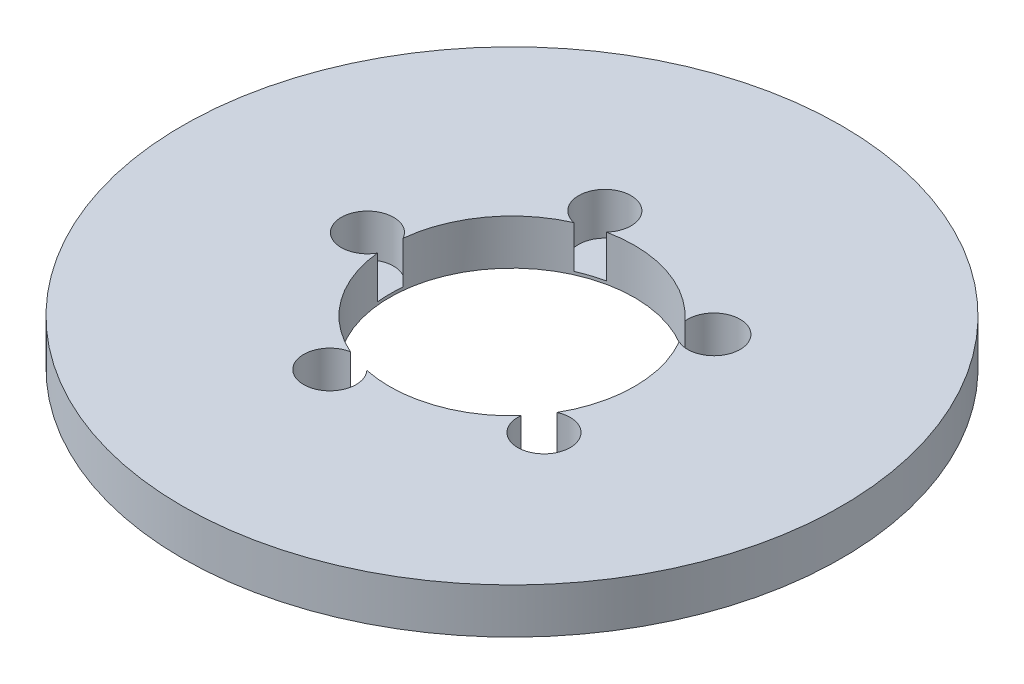
ISO-10303-21;
HEADER;
FILE_DESCRIPTION(('STEP AP214'),'2;1');
FILE_NAME('part.step','',(''),(''),'','','');
FILE_SCHEMA(('AUTOMOTIVE_DESIGN { 1 0 10303 214 1 1 1 1 }'));
ENDSEC;
DATA;
#1=APPLICATION_CONTEXT('core data for automotive mechanical design processes');
#2=APPLICATION_PROTOCOL_DEFINITION('international standard','automotive_design',2000,#1);
#3=PRODUCT_CONTEXT('',#1,'mechanical');
#4=PRODUCT('Part','Part','',(#3));
#5=PRODUCT_RELATED_PRODUCT_CATEGORY('part','',(#4));
#6=PRODUCT_DEFINITION_FORMATION('','',#4);
#7=PRODUCT_DEFINITION_CONTEXT('part definition',#1,'design');
#8=PRODUCT_DEFINITION('design','',#6,#7);
#9=PRODUCT_DEFINITION_SHAPE('','',#8);
#10=(LENGTH_UNIT() NAMED_UNIT(*) SI_UNIT(.MILLI.,.METRE.));
#11=(NAMED_UNIT(*) PLANE_ANGLE_UNIT() SI_UNIT($,.RADIAN.));
#12=(NAMED_UNIT(*) SI_UNIT($,.STERADIAN.) SOLID_ANGLE_UNIT());
#13=UNCERTAINTY_MEASURE_WITH_UNIT(LENGTH_MEASURE(1.E-05),#10,'distance_accuracy_value','');
#14=(GEOMETRIC_REPRESENTATION_CONTEXT(3) GLOBAL_UNCERTAINTY_ASSIGNED_CONTEXT((#13)) GLOBAL_UNIT_ASSIGNED_CONTEXT((#10,
#11,#12)) REPRESENTATION_CONTEXT('',''));
#15=CARTESIAN_POINT('',(0.,0.,0.));
#16=DIRECTION('',(0.,0.,1.));
#17=DIRECTION('',(1.,0.,0.));
#18=AXIS2_PLACEMENT_3D('',#15,#16,#17);
#19=CARTESIAN_POINT('',(0.,12.,0.));
#20=DIRECTION('',(0.,-1.,0.));
#21=DIRECTION('',(0.,0.,-1.));
#22=AXIS2_PLACEMENT_3D('',#19,#20,#21);
#23=CYLINDRICAL_SURFACE('',#22,87.5);
#24=CARTESIAN_POINT('',(0.,12.,0.));
#25=DIRECTION('',(0.,1.,0.));
#26=DIRECTION('',(0.,0.,1.));
#27=AXIS2_PLACEMENT_3D('',#24,#25,#26);
#28=CIRCLE('',#27,87.5);
#29=CARTESIAN_POINT('',(0.,12.,87.5));
#30=VERTEX_POINT('',#29);
#31=EDGE_CURVE('E160',#30,#30,#28,.T.);
#32=ORIENTED_EDGE('',*,*,#31,.F.);
#33=EDGE_LOOP('',(#32));
#34=FACE_BOUND('',#33,.T.);
#35=CARTESIAN_POINT('',(0.,0.,0.));
#36=DIRECTION('',(0.,1.,0.));
#37=DIRECTION('',(0.,0.,1.));
#38=AXIS2_PLACEMENT_3D('',#35,#36,#37);
#39=CIRCLE('',#38,87.5);
#40=CARTESIAN_POINT('',(0.,0.,87.5));
#41=VERTEX_POINT('',#40);
#42=EDGE_CURVE('E153',#41,#41,#39,.T.);
#43=ORIENTED_EDGE('',*,*,#42,.T.);
#44=EDGE_LOOP('',(#43));
#45=FACE_BOUND('',#44,.T.);
#46=ADVANCED_FACE('F39',(#34,#45),#23,.T.);
#47=CARTESIAN_POINT('',(0.,12.,0.));
#48=DIRECTION('',(0.,1.,0.));
#49=DIRECTION('',(0.,0.,1.));
#50=AXIS2_PLACEMENT_3D('',#47,#48,#49);
#51=PLANE('',#50);
#52=CARTESIAN_POINT('',(-11.860279917267,12.,36.5021882476634));
#53=DIRECTION('',(0.,1.,0.));
#54=DIRECTION('',(0.951056516295155,0.,0.309016994374945));
#55=AXIS2_PLACEMENT_3D('',#52,#53,#54);
#56=CIRCLE('',#55,6.96053116031876);
#57=CARTESIAN_POINT('',(-13.2416508527588,12.,29.6801058403374));
#58=VERTEX_POINT('',#57);
#59=CARTESIAN_POINT('',(-6.73280792596846,12.,31.7949571069378));
#60=VERTEX_POINT('',#59);
#61=EDGE_CURVE('E186',#58,#60,#56,.T.);
#62=ORIENTED_EDGE('',*,*,#61,.F.);
#63=CARTESIAN_POINT('',(0.,12.,0.));
#64=DIRECTION('',(0.,1.,0.));
#65=DIRECTION('',(0.,0.,1.));
#66=AXIS2_PLACEMENT_3D('',#63,#64,#65);
#67=CIRCLE('',#66,32.5);
#68=CARTESIAN_POINT('',(-32.3193532108647,12.,3.42190123051027));
#69=VERTEX_POINT('',#68);
#70=EDGE_CURVE('E148',#69,#58,#67,.T.);
#71=ORIENTED_EDGE('',*,*,#70,.F.);
#72=CARTESIAN_POINT('',(-38.3806720444521,12.,0.));
#73=DIRECTION('',(0.,1.,0.));
#74=DIRECTION('',(0.,0.,1.));
#75=AXIS2_PLACEMENT_3D('',#72,#73,#74);
#76=CIRCLE('',#75,6.96053116031876);
#77=CARTESIAN_POINT('',(-32.3193532108647,12.,-3.42190123051027));
#78=VERTEX_POINT('',#77);
#79=EDGE_CURVE('E142',#78,#69,#76,.T.);
#80=ORIENTED_EDGE('',*,*,#79,.F.);
#81=CARTESIAN_POINT('',(-13.2416508527593,12.,-29.6801058403372));
#82=VERTEX_POINT('',#81);
#83=EDGE_CURVE('E132',#82,#78,#67,.T.);
#84=ORIENTED_EDGE('',*,*,#83,.F.);
#85=CARTESIAN_POINT('',(-11.8602799172676,12.,-36.5021882476632));
#86=DIRECTION('',(0.,1.,0.));
#87=DIRECTION('',(-0.95105651629515,0.,0.309016994374958));
#88=AXIS2_PLACEMENT_3D('',#85,#86,#87);
#89=CIRCLE('',#88,6.96053116031876);
#90=CARTESIAN_POINT('',(-6.73280792596889,12.,-31.7949571069377));
#91=VERTEX_POINT('',#90);
#92=EDGE_CURVE('E111',#91,#82,#89,.T.);
#93=ORIENTED_EDGE('',*,*,#92,.F.);
#94=CARTESIAN_POINT('',(24.1355629167005,12.,-21.7652154295332));
#95=VERTEX_POINT('',#94);
#96=EDGE_CURVE('E141',#95,#91,#67,.T.);
#97=ORIENTED_EDGE('',*,*,#96,.F.);
#98=CARTESIAN_POINT('',(31.050615939493,12.,-22.5595930008032));
#99=DIRECTION('',(0.,1.,0.));
#100=DIRECTION('',(-0.58778525229248,0.,-0.809016994374942));
#101=AXIS2_PLACEMENT_3D('',#98,#99,#100);
#102=CIRCLE('',#101,6.96053116031876);
#103=CARTESIAN_POINT('',(28.1582490728913,12.,-16.2284629324226));
#104=VERTEX_POINT('',#103);
#105=EDGE_CURVE('E173',#104,#95,#102,.T.);
#106=ORIENTED_EDGE('',*,*,#105,.F.);
#107=CARTESIAN_POINT('',(28.1582490728916,12.,16.2284629324222));
#108=VERTEX_POINT('',#107);
#109=EDGE_CURVE('E150',#108,#104,#67,.T.);
#110=ORIENTED_EDGE('',*,*,#109,.F.);
#111=CARTESIAN_POINT('',(31.0506159394933,12.,22.5595930008028));
#112=DIRECTION('',(0.,1.,0.));
#113=DIRECTION('',(0.587785252292469,0.,-0.809016994374951));
#114=AXIS2_PLACEMENT_3D('',#111,#112,#113);
#115=CIRCLE('',#114,6.96053116031876);
#116=CARTESIAN_POINT('',(24.1355629167008,12.,21.7652154295329));
#117=VERTEX_POINT('',#116);
#118=EDGE_CURVE('E172',#117,#108,#115,.T.);
#119=ORIENTED_EDGE('',*,*,#118,.F.);
#120=EDGE_CURVE('E152',#60,#117,#67,.T.);
#121=ORIENTED_EDGE('',*,*,#120,.F.);
#122=EDGE_LOOP('',(#62,#71,#80,#84,#93,#97,#106,#110,#119,#121));
#123=FACE_BOUND('',#122,.T.);
#124=ORIENTED_EDGE('',*,*,#31,.T.);
#125=EDGE_LOOP('',(#124));
#126=FACE_BOUND('',#125,.T.);
#127=ADVANCED_FACE('F138',(#123,#126),#51,.T.);
#128=CARTESIAN_POINT('',(0.,0.,0.));
#129=DIRECTION('',(0.,1.,0.));
#130=DIRECTION('',(0.,0.,1.));
#131=AXIS2_PLACEMENT_3D('',#128,#129,#130);
#132=PLANE('',#131);
#133=CARTESIAN_POINT('',(0.,0.,0.));
#134=DIRECTION('',(0.,1.,0.));
#135=DIRECTION('',(0.,0.,1.));
#136=AXIS2_PLACEMENT_3D('',#133,#134,#135);
#137=CIRCLE('',#136,32.5);
#138=CARTESIAN_POINT('',(0.,0.,32.5));
#139=VERTEX_POINT('',#138);
#140=EDGE_CURVE('E145',#139,#139,#137,.T.);
#141=ORIENTED_EDGE('',*,*,#140,.T.);
#142=EDGE_LOOP('',(#141));
#143=FACE_BOUND('',#142,.T.);
#144=ORIENTED_EDGE('',*,*,#42,.F.);
#145=EDGE_LOOP('',(#144));
#146=FACE_BOUND('',#145,.T.);
#147=ADVANCED_FACE('F216',(#143,#146),#132,.F.);
#148=CARTESIAN_POINT('',(0.,12.,0.));
#149=DIRECTION('',(0.,-1.,0.));
#150=DIRECTION('',(0.,0.,-1.));
#151=AXIS2_PLACEMENT_3D('',#148,#149,#150);
#152=CYLINDRICAL_SURFACE('',#151,32.5);
#153=DIRECTION('',(0.,1.,0.));
#154=VECTOR('',#153,1.);
#155=CARTESIAN_POINT('',(-13.2416508527588,6.38565406496938,29.6801058403374));
#156=LINE('',#155,#154);
#157=CARTESIAN_POINT('',(-13.2416508527588,0.771308129938766,29.6801058403374));
#158=VERTEX_POINT('',#157);
#159=EDGE_CURVE('E11',#158,#58,#156,.T.);
#160=ORIENTED_EDGE('',*,*,#159,.F.);
#161=CARTESIAN_POINT('',(0.,0.771308129938766,0.));
#162=DIRECTION('',(0.,1.,0.));
#163=DIRECTION('',(0.,0.,1.));
#164=AXIS2_PLACEMENT_3D('',#161,#162,#163);
#165=CIRCLE('',#164,32.5);
#166=CARTESIAN_POINT('',(-6.73280792596846,0.771308129938766,31.7949571069378));
#167=VERTEX_POINT('',#166);
#168=EDGE_CURVE('E192',#158,#167,#165,.T.);
#169=ORIENTED_EDGE('',*,*,#168,.T.);
#170=DIRECTION('',(0.,1.,0.));
#171=VECTOR('',#170,1.);
#172=CARTESIAN_POINT('',(-6.73280792596844,6.38565406496938,31.7949571069378));
#173=LINE('',#172,#171);
#174=EDGE_CURVE('E46',#60,#167,#173,.F.);
#175=ORIENTED_EDGE('',*,*,#174,.F.);
#176=ORIENTED_EDGE('',*,*,#120,.T.);
#177=DIRECTION('',(0.,1.,0.));
#178=VECTOR('',#177,1.);
#179=CARTESIAN_POINT('',(24.1355629167008,6.38565406496938,21.7652154295329));
#180=LINE('',#179,#178);
#181=CARTESIAN_POINT('',(24.1355629167008,0.771308129938766,21.7652154295329));
#182=VERTEX_POINT('',#181);
#183=EDGE_CURVE('E195',#182,#117,#180,.T.);
#184=ORIENTED_EDGE('',*,*,#183,.F.);
#185=CARTESIAN_POINT('',(0.,0.771308129938766,0.));
#186=DIRECTION('',(0.,1.,0.));
#187=DIRECTION('',(0.,0.,1.));
#188=AXIS2_PLACEMENT_3D('',#185,#186,#187);
#189=CIRCLE('',#188,32.5);
#190=CARTESIAN_POINT('',(28.1582490728916,0.771308129938766,16.2284629324222));
#191=VERTEX_POINT('',#190);
#192=EDGE_CURVE('E197',#182,#191,#189,.T.);
#193=ORIENTED_EDGE('',*,*,#192,.T.);
#194=DIRECTION('',(0.,1.,0.));
#195=VECTOR('',#194,1.);
#196=CARTESIAN_POINT('',(28.1582490728916,6.38565406496938,16.2284629324222));
#197=LINE('',#196,#195);
#198=EDGE_CURVE('E168',#108,#191,#197,.F.);
#199=ORIENTED_EDGE('',*,*,#198,.F.);
#200=ORIENTED_EDGE('',*,*,#109,.T.);
#201=DIRECTION('',(0.,1.,0.));
#202=VECTOR('',#201,1.);
#203=CARTESIAN_POINT('',(28.1582490728914,6.38565406496938,-16.2284629324226));
#204=LINE('',#203,#202);
#205=CARTESIAN_POINT('',(28.1582490728913,0.771308129938766,-16.2284629324226));
#206=VERTEX_POINT('',#205);
#207=EDGE_CURVE('E169',#206,#104,#204,.T.);
#208=ORIENTED_EDGE('',*,*,#207,.F.);
#209=CARTESIAN_POINT('',(0.,0.771308129938766,0.));
#210=DIRECTION('',(0.,1.,0.));
#211=DIRECTION('',(0.,0.,1.));
#212=AXIS2_PLACEMENT_3D('',#209,#210,#211);
#213=CIRCLE('',#212,32.5);
#214=CARTESIAN_POINT('',(24.1355629167005,0.771308129938766,-21.7652154295332));
#215=VERTEX_POINT('',#214);
#216=EDGE_CURVE('E332',#206,#215,#213,.T.);
#217=ORIENTED_EDGE('',*,*,#216,.T.);
#218=DIRECTION('',(0.,1.,0.));
#219=VECTOR('',#218,1.);
#220=CARTESIAN_POINT('',(24.1355629167005,6.38565406496938,-21.7652154295332));
#221=LINE('',#220,#219);
#222=EDGE_CURVE('E335',#95,#215,#221,.F.);
#223=ORIENTED_EDGE('',*,*,#222,.F.);
#224=ORIENTED_EDGE('',*,*,#96,.T.);
#225=DIRECTION('',(0.,1.,0.));
#226=VECTOR('',#225,1.);
#227=CARTESIAN_POINT('',(-6.73280792596889,6.38565406496938,-31.7949571069377));
#228=LINE('',#227,#226);
#229=CARTESIAN_POINT('',(-6.73280792596889,0.771308129938766,-31.7949571069377));
#230=VERTEX_POINT('',#229);
#231=EDGE_CURVE('E121',#230,#91,#228,.T.);
#232=ORIENTED_EDGE('',*,*,#231,.F.);
#233=CARTESIAN_POINT('',(0.,0.771308129938766,0.));
#234=DIRECTION('',(0.,1.,0.));
#235=DIRECTION('',(0.,0.,1.));
#236=AXIS2_PLACEMENT_3D('',#233,#234,#235);
#237=CIRCLE('',#236,32.5);
#238=CARTESIAN_POINT('',(-13.2416508527593,0.771308129938766,-29.6801058403372));
#239=VERTEX_POINT('',#238);
#240=EDGE_CURVE('E134',#230,#239,#237,.T.);
#241=ORIENTED_EDGE('',*,*,#240,.T.);
#242=DIRECTION('',(0.,1.,0.));
#243=VECTOR('',#242,1.);
#244=CARTESIAN_POINT('',(-13.2416508527593,6.38565406496938,-29.6801058403372));
#245=LINE('',#244,#243);
#246=EDGE_CURVE('E117',#82,#239,#245,.F.);
#247=ORIENTED_EDGE('',*,*,#246,.F.);
#248=ORIENTED_EDGE('',*,*,#83,.T.);
#249=DIRECTION('',(0.,1.,0.));
#250=VECTOR('',#249,1.);
#251=CARTESIAN_POINT('',(-32.3193532108647,6.38565406496938,-3.42190123051027));
#252=LINE('',#251,#250);
#253=CARTESIAN_POINT('',(-32.3193532108647,0.771308129938766,-3.42190123051027));
#254=VERTEX_POINT('',#253);
#255=EDGE_CURVE('E338',#254,#78,#252,.T.);
#256=ORIENTED_EDGE('',*,*,#255,.F.);
#257=CARTESIAN_POINT('',(0.,0.771308129938766,0.));
#258=DIRECTION('',(0.,1.,0.));
#259=DIRECTION('',(0.,0.,1.));
#260=AXIS2_PLACEMENT_3D('',#257,#258,#259);
#261=CIRCLE('',#260,32.5);
#262=CARTESIAN_POINT('',(-32.3193532108647,0.771308129938766,3.42190123051027));
#263=VERTEX_POINT('',#262);
#264=EDGE_CURVE('E342',#254,#263,#261,.T.);
#265=ORIENTED_EDGE('',*,*,#264,.T.);
#266=DIRECTION('',(0.,1.,0.));
#267=VECTOR('',#266,1.);
#268=CARTESIAN_POINT('',(-32.3193532108647,6.38565406496938,3.42190123051027));
#269=LINE('',#268,#267);
#270=EDGE_CURVE('E341',#69,#263,#269,.F.);
#271=ORIENTED_EDGE('',*,*,#270,.F.);
#272=ORIENTED_EDGE('',*,*,#70,.T.);
#273=EDGE_LOOP('',(#160,#169,#175,#176,#184,#193,#199,#200,#208,#217,#223,#224,#232,#241,#247,
#248,#256,#265,#271,#272));
#274=FACE_BOUND('',#273,.T.);
#275=ORIENTED_EDGE('',*,*,#140,.F.);
#276=EDGE_LOOP('',(#275));
#277=FACE_BOUND('',#276,.T.);
#278=ADVANCED_FACE('F128',(#274,#277),#152,.F.);
#279=CARTESIAN_POINT('',(-38.3806720444521,0.771308129938766,0.));
#280=DIRECTION('',(0.,1.,0.));
#281=DIRECTION('',(0.,0.,1.));
#282=AXIS2_PLACEMENT_3D('',#279,#280,#281);
#283=CYLINDRICAL_SURFACE('',#282,6.96053116031876);
#284=ORIENTED_EDGE('',*,*,#255,.T.);
#285=ORIENTED_EDGE('',*,*,#79,.T.);
#286=ORIENTED_EDGE('',*,*,#270,.T.);
#287=CARTESIAN_POINT('',(-38.3806720444521,0.771308129938766,0.));
#288=DIRECTION('',(0.,1.,0.));
#289=DIRECTION('',(0.,0.,1.));
#290=AXIS2_PLACEMENT_3D('',#287,#288,#289);
#291=CIRCLE('',#290,6.96053116031876);
#292=EDGE_CURVE('E149',#254,#263,#291,.T.);
#293=ORIENTED_EDGE('',*,*,#292,.F.);
#294=EDGE_LOOP('',(#284,#285,#286,#293));
#295=FACE_BOUND('',#294,.T.);
#296=ADVANCED_FACE('F227',(#295),#283,.F.);
#297=CARTESIAN_POINT('',(-38.3806720444521,0.771308129938766,0.));
#298=DIRECTION('',(0.,1.,0.));
#299=DIRECTION('',(0.,0.,1.));
#300=AXIS2_PLACEMENT_3D('',#297,#298,#299);
#301=PLANE('',#300);
#302=ORIENTED_EDGE('',*,*,#292,.T.);
#303=ORIENTED_EDGE('',*,*,#264,.F.);
#304=EDGE_LOOP('',(#302,#303));
#305=FACE_BOUND('',#304,.T.);
#306=ADVANCED_FACE('F235',(#305),#301,.T.);
#307=CARTESIAN_POINT('',(-11.8602799172676,0.771308129938766,-36.5021882476632));
#308=DIRECTION('',(0.,1.,0.));
#309=DIRECTION('',(0.,0.,1.));
#310=AXIS2_PLACEMENT_3D('',#307,#308,#309);
#311=CYLINDRICAL_SURFACE('',#310,6.96053116031876);
#312=ORIENTED_EDGE('',*,*,#231,.T.);
#313=ORIENTED_EDGE('',*,*,#92,.T.);
#314=ORIENTED_EDGE('',*,*,#246,.T.);
#315=CARTESIAN_POINT('',(-11.8602799172676,0.771308129938766,-36.5021882476632));
#316=DIRECTION('',(0.,1.,0.));
#317=DIRECTION('',(-0.95105651629515,0.,0.309016994374958));
#318=AXIS2_PLACEMENT_3D('',#315,#316,#317);
#319=CIRCLE('',#318,6.96053116031876);
#320=EDGE_CURVE('E127',#230,#239,#319,.T.);
#321=ORIENTED_EDGE('',*,*,#320,.F.);
#322=EDGE_LOOP('',(#312,#313,#314,#321));
#323=FACE_BOUND('',#322,.T.);
#324=ADVANCED_FACE('F116',(#323),#311,.F.);
#325=CARTESIAN_POINT('',(-11.8602799172676,0.771308129938766,-36.5021882476632));
#326=DIRECTION('',(0.,1.,0.));
#327=DIRECTION('',(-0.95105651629515,0.,0.309016994374958));
#328=AXIS2_PLACEMENT_3D('',#325,#326,#327);
#329=PLANE('',#328);
#330=ORIENTED_EDGE('',*,*,#320,.T.);
#331=ORIENTED_EDGE('',*,*,#240,.F.);
#332=EDGE_LOOP('',(#330,#331));
#333=FACE_BOUND('',#332,.T.);
#334=ADVANCED_FACE('F236',(#333),#329,.T.);
#335=CARTESIAN_POINT('',(31.050615939493,0.771308129938766,-22.5595930008032));
#336=DIRECTION('',(0.,1.,0.));
#337=DIRECTION('',(0.,0.,1.));
#338=AXIS2_PLACEMENT_3D('',#335,#336,#337);
#339=CYLINDRICAL_SURFACE('',#338,6.96053116031876);
#340=ORIENTED_EDGE('',*,*,#207,.T.);
#341=ORIENTED_EDGE('',*,*,#105,.T.);
#342=ORIENTED_EDGE('',*,*,#222,.T.);
#343=CARTESIAN_POINT('',(31.050615939493,0.771308129938766,-22.5595930008032));
#344=DIRECTION('',(0.,1.,0.));
#345=DIRECTION('',(-0.58778525229248,0.,-0.809016994374942));
#346=AXIS2_PLACEMENT_3D('',#343,#344,#345);
#347=CIRCLE('',#346,6.96053116031876);
#348=EDGE_CURVE('E177',#206,#215,#347,.T.);
#349=ORIENTED_EDGE('',*,*,#348,.F.);
#350=EDGE_LOOP('',(#340,#341,#342,#349));
#351=FACE_BOUND('',#350,.T.);
#352=ADVANCED_FACE('F241',(#351),#339,.F.);
#353=CARTESIAN_POINT('',(31.050615939493,0.771308129938766,-22.5595930008032));
#354=DIRECTION('',(0.,1.,0.));
#355=DIRECTION('',(-0.58778525229248,0.,-0.809016994374942));
#356=AXIS2_PLACEMENT_3D('',#353,#354,#355);
#357=PLANE('',#356);
#358=ORIENTED_EDGE('',*,*,#348,.T.);
#359=ORIENTED_EDGE('',*,*,#216,.F.);
#360=EDGE_LOOP('',(#358,#359));
#361=FACE_BOUND('',#360,.T.);
#362=ADVANCED_FACE('F244',(#361),#357,.T.);
#363=CARTESIAN_POINT('',(31.0506159394933,0.771308129938766,22.5595930008028));
#364=DIRECTION('',(0.,1.,0.));
#365=DIRECTION('',(0.,0.,1.));
#366=AXIS2_PLACEMENT_3D('',#363,#364,#365);
#367=CYLINDRICAL_SURFACE('',#366,6.96053116031876);
#368=ORIENTED_EDGE('',*,*,#183,.T.);
#369=ORIENTED_EDGE('',*,*,#118,.T.);
#370=ORIENTED_EDGE('',*,*,#198,.T.);
#371=CARTESIAN_POINT('',(31.0506159394933,0.771308129938766,22.5595930008028));
#372=DIRECTION('',(0.,1.,0.));
#373=DIRECTION('',(0.587785252292469,0.,-0.809016994374951));
#374=AXIS2_PLACEMENT_3D('',#371,#372,#373);
#375=CIRCLE('',#374,6.96053116031876);
#376=EDGE_CURVE('E56',#182,#191,#375,.T.);
#377=ORIENTED_EDGE('',*,*,#376,.F.);
#378=EDGE_LOOP('',(#368,#369,#370,#377));
#379=FACE_BOUND('',#378,.T.);
#380=ADVANCED_FACE('F191',(#379),#367,.F.);
#381=CARTESIAN_POINT('',(31.0506159394933,0.771308129938766,22.5595930008028));
#382=DIRECTION('',(0.,1.,0.));
#383=DIRECTION('',(0.587785252292469,0.,-0.809016994374951));
#384=AXIS2_PLACEMENT_3D('',#381,#382,#383);
#385=PLANE('',#384);
#386=ORIENTED_EDGE('',*,*,#376,.T.);
#387=ORIENTED_EDGE('',*,*,#192,.F.);
#388=EDGE_LOOP('',(#386,#387));
#389=FACE_BOUND('',#388,.T.);
#390=ADVANCED_FACE('F208',(#389),#385,.T.);
#391=CARTESIAN_POINT('',(-11.860279917267,0.771308129938766,36.5021882476634));
#392=DIRECTION('',(0.,1.,0.));
#393=DIRECTION('',(0.,0.,1.));
#394=AXIS2_PLACEMENT_3D('',#391,#392,#393);
#395=CYLINDRICAL_SURFACE('',#394,6.96053116031876);
#396=ORIENTED_EDGE('',*,*,#159,.T.);
#397=ORIENTED_EDGE('',*,*,#61,.T.);
#398=ORIENTED_EDGE('',*,*,#174,.T.);
#399=CARTESIAN_POINT('',(-11.860279917267,0.771308129938766,36.5021882476634));
#400=DIRECTION('',(0.,1.,0.));
#401=DIRECTION('',(0.951056516295155,0.,0.309016994374945));
#402=AXIS2_PLACEMENT_3D('',#399,#400,#401);
#403=CIRCLE('',#402,6.96053116031876);
#404=EDGE_CURVE('E55',#158,#167,#403,.T.);
#405=ORIENTED_EDGE('',*,*,#404,.F.);
#406=EDGE_LOOP('',(#396,#397,#398,#405));
#407=FACE_BOUND('',#406,.T.);
#408=ADVANCED_FACE('F203',(#407),#395,.F.);
#409=CARTESIAN_POINT('',(-11.860279917267,0.771308129938766,36.5021882476634));
#410=DIRECTION('',(0.,1.,0.));
#411=DIRECTION('',(0.951056516295155,0.,0.309016994374945));
#412=AXIS2_PLACEMENT_3D('',#409,#410,#411);
#413=PLANE('',#412);
#414=ORIENTED_EDGE('',*,*,#404,.T.);
#415=ORIENTED_EDGE('',*,*,#168,.F.);
#416=EDGE_LOOP('',(#414,#415));
#417=FACE_BOUND('',#416,.T.);
#418=ADVANCED_FACE('F205',(#417),#413,.T.);
#419=CLOSED_SHELL('',(#46,#127,#147,#278,#296,#306,#324,#334,#352,#362,#380,#390,#408,#418));
#420=MANIFOLD_SOLID_BREP('B2',#419);
#421=ADVANCED_BREP_SHAPE_REPRESENTATION('',(#18,#420),#14);
#422=SHAPE_DEFINITION_REPRESENTATION(#9,#421);
ENDSEC;
END-ISO-10303-21;
